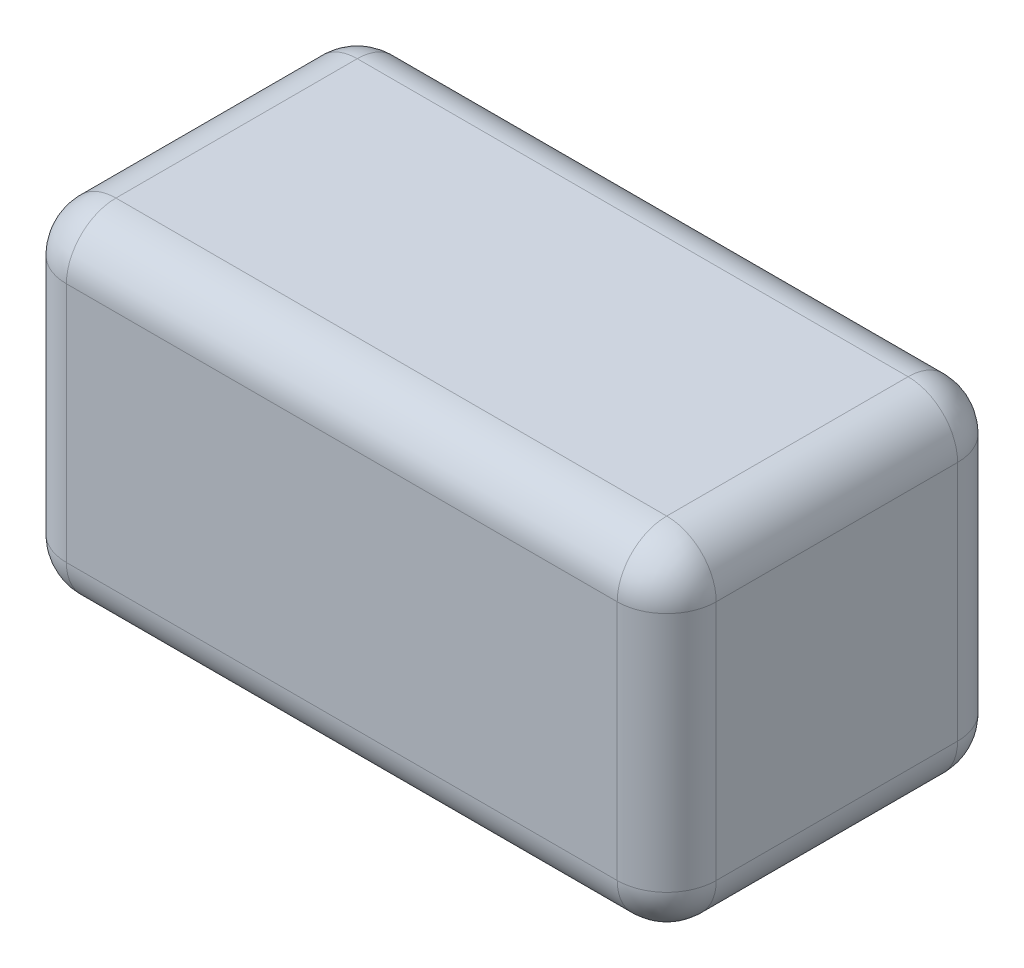
ISO-10303-21;
HEADER;
FILE_DESCRIPTION(('STEP AP214'),'2;1');
FILE_NAME('part.step','',(''),(''),'','','');
FILE_SCHEMA(('AUTOMOTIVE_DESIGN { 1 0 10303 214 1 1 1 1 }'));
ENDSEC;
DATA;
#1=APPLICATION_CONTEXT('core data for automotive mechanical design processes');
#2=APPLICATION_PROTOCOL_DEFINITION('international standard','automotive_design',2000,#1);
#3=PRODUCT_CONTEXT('',#1,'mechanical');
#4=PRODUCT('Part','Part','',(#3));
#5=PRODUCT_RELATED_PRODUCT_CATEGORY('part','',(#4));
#6=PRODUCT_DEFINITION_FORMATION('','',#4);
#7=PRODUCT_DEFINITION_CONTEXT('part definition',#1,'design');
#8=PRODUCT_DEFINITION('design','',#6,#7);
#9=PRODUCT_DEFINITION_SHAPE('','',#8);
#10=(LENGTH_UNIT() NAMED_UNIT(*) SI_UNIT(.MILLI.,.METRE.));
#11=(NAMED_UNIT(*) PLANE_ANGLE_UNIT() SI_UNIT($,.RADIAN.));
#12=(NAMED_UNIT(*) SI_UNIT($,.STERADIAN.) SOLID_ANGLE_UNIT());
#13=UNCERTAINTY_MEASURE_WITH_UNIT(LENGTH_MEASURE(1.E-05),#10,'distance_accuracy_value','');
#14=(GEOMETRIC_REPRESENTATION_CONTEXT(3) GLOBAL_UNCERTAINTY_ASSIGNED_CONTEXT((#13)) GLOBAL_UNIT_ASSIGNED_CONTEXT((#10,
#11,#12)) REPRESENTATION_CONTEXT('',''));
#15=CARTESIAN_POINT('',(0.,0.,0.));
#16=DIRECTION('',(0.,0.,1.));
#17=DIRECTION('',(1.,0.,0.));
#18=AXIS2_PLACEMENT_3D('',#15,#16,#17);
#19=CARTESIAN_POINT('',(0.445,0.195,0.47));
#20=DIRECTION('',(1.,0.,0.));
#21=DIRECTION('',(0.,1.,0.));
#22=AXIS2_PLACEMENT_3D('',#19,#20,#21);
#23=SPHERICAL_SURFACE('',#22,0.08);
#24=CARTESIAN_POINT('',(0.445,0.195,0.47));
#25=DIRECTION('',(1.,0.,0.));
#26=DIRECTION('',(0.,0.,-1.));
#27=AXIS2_PLACEMENT_3D('',#24,#25,#26);
#28=CIRCLE('',#27,0.08);
#29=CARTESIAN_POINT('',(0.445,0.195,0.55));
#30=VERTEX_POINT('',#29);
#31=CARTESIAN_POINT('',(0.445,0.275,0.470000000055542));
#32=VERTEX_POINT('',#31);
#33=EDGE_CURVE('E238',#30,#32,#28,.F.);
#34=ORIENTED_EDGE('',*,*,#33,.F.);
#35=CARTESIAN_POINT('',(0.445,0.195,0.47));
#36=DIRECTION('',(0.,-1.,0.));
#37=DIRECTION('',(1.,0.,0.));
#38=AXIS2_PLACEMENT_3D('',#35,#36,#37);
#39=CIRCLE('',#38,0.08);
#40=CARTESIAN_POINT('',(0.525,0.195,0.47));
#41=VERTEX_POINT('',#40);
#42=EDGE_CURVE('E134',#41,#30,#39,.T.);
#43=ORIENTED_EDGE('',*,*,#42,.F.);
#44=CARTESIAN_POINT('',(0.445,0.195,0.47));
#45=DIRECTION('',(0.,0.,-1.));
#46=DIRECTION('',(-1.,0.,0.));
#47=AXIS2_PLACEMENT_3D('',#44,#45,#46);
#48=CIRCLE('',#47,0.08);
#49=EDGE_CURVE('E211',#32,#41,#48,.T.);
#50=ORIENTED_EDGE('',*,*,#49,.F.);
#51=EDGE_LOOP('',(#34,#43,#50));
#52=FACE_BOUND('',#51,.T.);
#53=ADVANCED_FACE('F16',(#52),#23,.T.);
#54=CARTESIAN_POINT('',(-0.445,0.195,0.47));
#55=DIRECTION('',(0.,1.,0.));
#56=DIRECTION('',(-1.,0.,0.));
#57=AXIS2_PLACEMENT_3D('',#54,#55,#56);
#58=SPHERICAL_SURFACE('',#57,0.08);
#59=CARTESIAN_POINT('',(-0.445,0.195,0.47));
#60=DIRECTION('',(0.,-1.,0.));
#61=DIRECTION('',(0.,0.,-1.));
#62=AXIS2_PLACEMENT_3D('',#59,#60,#61);
#63=CIRCLE('',#62,0.08);
#64=CARTESIAN_POINT('',(-0.445,0.195000000110152,0.55));
#65=VERTEX_POINT('',#64);
#66=CARTESIAN_POINT('',(-0.525,0.195,0.47));
#67=VERTEX_POINT('',#66);
#68=EDGE_CURVE('E397',#65,#67,#63,.T.);
#69=ORIENTED_EDGE('',*,*,#68,.F.);
#70=CARTESIAN_POINT('',(-0.445,0.195,0.47));
#71=DIRECTION('',(1.,0.,0.));
#72=DIRECTION('',(0.,0.,-1.));
#73=AXIS2_PLACEMENT_3D('',#70,#71,#72);
#74=CIRCLE('',#73,0.08);
#75=CARTESIAN_POINT('',(-0.445,0.275,0.470000000111199));
#76=VERTEX_POINT('',#75);
#77=EDGE_CURVE('E237',#76,#65,#74,.T.);
#78=ORIENTED_EDGE('',*,*,#77,.F.);
#79=CARTESIAN_POINT('',(-0.445,0.195,0.47));
#80=DIRECTION('',(0.,0.,1.));
#81=DIRECTION('',(1.,0.,0.));
#82=AXIS2_PLACEMENT_3D('',#79,#80,#81);
#83=CIRCLE('',#82,0.08);
#84=EDGE_CURVE('E199',#67,#76,#83,.F.);
#85=ORIENTED_EDGE('',*,*,#84,.F.);
#86=EDGE_LOOP('',(#69,#78,#85));
#87=FACE_BOUND('',#86,.T.);
#88=ADVANCED_FACE('F224',(#87),#58,.T.);
#89=CARTESIAN_POINT('',(0.445,0.195,0.87));
#90=DIRECTION('',(0.,0.,-1.));
#91=DIRECTION('',(-1.,0.,0.));
#92=AXIS2_PLACEMENT_3D('',#89,#90,#91);
#93=CYLINDRICAL_SURFACE('',#92,0.08);
#94=CARTESIAN_POINT('',(0.445,0.195,0.08));
#95=DIRECTION('',(0.,0.,-1.));
#96=DIRECTION('',(0.,1.,0.));
#97=AXIS2_PLACEMENT_3D('',#94,#95,#96);
#98=CIRCLE('',#97,0.08);
#99=CARTESIAN_POINT('',(0.445,0.275,0.0799999998888023));
#100=VERTEX_POINT('',#99);
#101=CARTESIAN_POINT('',(0.525,0.195,0.0799999999999999));
#102=VERTEX_POINT('',#101);
#103=EDGE_CURVE('E197',#100,#102,#98,.T.);
#104=ORIENTED_EDGE('',*,*,#103,.F.);
#105=DIRECTION('',(0.,0.,1.));
#106=VECTOR('',#105,1.);
#107=CARTESIAN_POINT('',(0.445,0.275,0.));
#108=LINE('',#107,#106);
#109=EDGE_CURVE('E200',#32,#100,#108,.F.);
#110=ORIENTED_EDGE('',*,*,#109,.F.);
#111=ORIENTED_EDGE('',*,*,#49,.T.);
#112=DIRECTION('',(0.,0.,-1.));
#113=VECTOR('',#112,1.);
#114=CARTESIAN_POINT('',(0.525,0.195,0.55));
#115=LINE('',#114,#113);
#116=EDGE_CURVE('E216',#102,#41,#115,.F.);
#117=ORIENTED_EDGE('',*,*,#116,.F.);
#118=EDGE_LOOP('',(#104,#110,#111,#117));
#119=FACE_BOUND('',#118,.T.);
#120=ADVANCED_FACE('F221',(#119),#93,.T.);
#121=CARTESIAN_POINT('',(-0.445,0.195,0.08));
#122=DIRECTION('',(-1.,0.,0.));
#123=DIRECTION('',(0.,1.,0.));
#124=AXIS2_PLACEMENT_3D('',#121,#122,#123);
#125=SPHERICAL_SURFACE('',#124,0.08);
#126=CARTESIAN_POINT('',(-0.445,0.195,0.08));
#127=DIRECTION('',(0.,-1.,0.));
#128=DIRECTION('',(0.,0.,-1.));
#129=AXIS2_PLACEMENT_3D('',#126,#127,#128);
#130=CIRCLE('',#129,0.08);
#131=CARTESIAN_POINT('',(-0.525,0.195,0.08));
#132=VERTEX_POINT('',#131);
#133=CARTESIAN_POINT('',(-0.445,0.195,0.));
#134=VERTEX_POINT('',#133);
#135=EDGE_CURVE('E386',#132,#134,#130,.T.);
#136=ORIENTED_EDGE('',*,*,#135,.F.);
#137=CARTESIAN_POINT('',(-0.445,0.195,0.08));
#138=DIRECTION('',(0.,0.,1.));
#139=DIRECTION('',(1.,0.,0.));
#140=AXIS2_PLACEMENT_3D('',#137,#138,#139);
#141=CIRCLE('',#140,0.08);
#142=CARTESIAN_POINT('',(-0.445,0.275,0.08));
#143=VERTEX_POINT('',#142);
#144=EDGE_CURVE('E245',#143,#132,#141,.T.);
#145=ORIENTED_EDGE('',*,*,#144,.F.);
#146=CARTESIAN_POINT('',(-0.445,0.195,0.08));
#147=DIRECTION('',(-1.,0.,0.));
#148=DIRECTION('',(0.,0.,1.));
#149=AXIS2_PLACEMENT_3D('',#146,#147,#148);
#150=CIRCLE('',#149,0.08);
#151=EDGE_CURVE('E207',#134,#143,#150,.F.);
#152=ORIENTED_EDGE('',*,*,#151,.F.);
#153=EDGE_LOOP('',(#136,#145,#152));
#154=FACE_BOUND('',#153,.T.);
#155=ADVANCED_FACE('F218',(#154),#125,.T.);
#156=CARTESIAN_POINT('',(0.,0.275,0.));
#157=DIRECTION('',(0.,1.,0.));
#158=DIRECTION('',(0.,0.,1.));
#159=AXIS2_PLACEMENT_3D('',#156,#157,#158);
#160=PLANE('',#159);
#161=DIRECTION('',(1.,0.,0.));
#162=VECTOR('',#161,1.);
#163=CARTESIAN_POINT('',(-0.765,0.275,0.470000000222398));
#164=LINE('',#163,#162);
#165=EDGE_CURVE('E234',#32,#76,#164,.F.);
#166=ORIENTED_EDGE('',*,*,#165,.F.);
#167=ORIENTED_EDGE('',*,*,#109,.T.);
#168=DIRECTION('',(-1.,0.,0.));
#169=VECTOR('',#168,1.);
#170=CARTESIAN_POINT('',(0.765,0.275,0.0799999997776047));
#171=LINE('',#170,#169);
#172=EDGE_CURVE('E203',#143,#100,#171,.F.);
#173=ORIENTED_EDGE('',*,*,#172,.F.);
#174=DIRECTION('',(0.,0.,1.));
#175=VECTOR('',#174,1.);
#176=CARTESIAN_POINT('',(-0.445,0.275,-0.32));
#177=LINE('',#176,#175);
#178=EDGE_CURVE('E242',#76,#143,#177,.F.);
#179=ORIENTED_EDGE('',*,*,#178,.F.);
#180=EDGE_LOOP('',(#166,#167,#173,#179));
#181=FACE_BOUND('',#180,.T.);
#182=ADVANCED_FACE('F189',(#181),#160,.T.);
#183=CARTESIAN_POINT('',(0.445,0.195,0.08));
#184=DIRECTION('',(0.,1.,0.));
#185=DIRECTION('',(1.,0.,0.));
#186=AXIS2_PLACEMENT_3D('',#183,#184,#185);
#187=SPHERICAL_SURFACE('',#186,0.08);
#188=CARTESIAN_POINT('',(0.445,0.195,0.0799999999999999));
#189=DIRECTION('',(-1.,0.,0.));
#190=DIRECTION('',(0.,0.,1.));
#191=AXIS2_PLACEMENT_3D('',#188,#189,#190);
#192=CIRCLE('',#191,0.08);
#193=CARTESIAN_POINT('',(0.445,0.195000000110294,0.));
#194=VERTEX_POINT('',#193);
#195=EDGE_CURVE('E206',#100,#194,#192,.T.);
#196=ORIENTED_EDGE('',*,*,#195,.F.);
#197=ORIENTED_EDGE('',*,*,#103,.T.);
#198=CARTESIAN_POINT('',(0.445,0.195,0.0799999999999999));
#199=DIRECTION('',(0.,-1.,0.));
#200=DIRECTION('',(0.,0.,-1.));
#201=AXIS2_PLACEMENT_3D('',#198,#199,#200);
#202=CIRCLE('',#201,0.08);
#203=EDGE_CURVE('E383',#194,#102,#202,.T.);
#204=ORIENTED_EDGE('',*,*,#203,.F.);
#205=EDGE_LOOP('',(#196,#197,#204));
#206=FACE_BOUND('',#205,.T.);
#207=ADVANCED_FACE('F184',(#206),#187,.T.);
#208=CARTESIAN_POINT('',(-0.445,0.195,-0.32));
#209=DIRECTION('',(0.,0.,1.));
#210=DIRECTION('',(1.,0.,0.));
#211=AXIS2_PLACEMENT_3D('',#208,#209,#210);
#212=CYLINDRICAL_SURFACE('',#211,0.08);
#213=ORIENTED_EDGE('',*,*,#144,.T.);
#214=DIRECTION('',(0.,0.,1.));
#215=VECTOR('',#214,1.);
#216=CARTESIAN_POINT('',(-0.525,0.195,0.));
#217=LINE('',#216,#215);
#218=EDGE_CURVE('E415',#67,#132,#217,.F.);
#219=ORIENTED_EDGE('',*,*,#218,.F.);
#220=ORIENTED_EDGE('',*,*,#84,.T.);
#221=ORIENTED_EDGE('',*,*,#178,.T.);
#222=EDGE_LOOP('',(#213,#219,#220,#221));
#223=FACE_BOUND('',#222,.T.);
#224=ADVANCED_FACE('F181',(#223),#212,.T.);
#225=CARTESIAN_POINT('',(0.445,-0.515,0.47));
#226=DIRECTION('',(0.,-1.,0.));
#227=DIRECTION('',(1.,0.,0.));
#228=AXIS2_PLACEMENT_3D('',#225,#226,#227);
#229=CYLINDRICAL_SURFACE('',#228,0.08);
#230=DIRECTION('',(0.,1.,0.));
#231=VECTOR('',#230,1.);
#232=CARTESIAN_POINT('',(0.525,-0.275,0.47));
#233=LINE('',#232,#231);
#234=CARTESIAN_POINT('',(0.525,-0.195,0.47));
#235=VERTEX_POINT('',#234);
#236=EDGE_CURVE('E395',#41,#235,#233,.F.);
#237=ORIENTED_EDGE('',*,*,#236,.F.);
#238=ORIENTED_EDGE('',*,*,#42,.T.);
#239=DIRECTION('',(0.,1.,0.));
#240=VECTOR('',#239,1.);
#241=CARTESIAN_POINT('',(0.445,-0.275,0.55));
#242=LINE('',#241,#240);
#243=CARTESIAN_POINT('',(0.445,-0.195000000111199,0.55));
#244=VERTEX_POINT('',#243);
#245=EDGE_CURVE('E108',#244,#30,#242,.T.);
#246=ORIENTED_EDGE('',*,*,#245,.F.);
#247=CARTESIAN_POINT('',(0.445,-0.195,0.47));
#248=DIRECTION('',(0.,-1.,0.));
#249=DIRECTION('',(1.,0.,0.));
#250=AXIS2_PLACEMENT_3D('',#247,#248,#249);
#251=CIRCLE('',#250,0.08);
#252=EDGE_CURVE('E119',#235,#244,#251,.T.);
#253=ORIENTED_EDGE('',*,*,#252,.F.);
#254=EDGE_LOOP('',(#237,#238,#246,#253));
#255=FACE_BOUND('',#254,.T.);
#256=ADVANCED_FACE('F132',(#255),#229,.T.);
#257=CARTESIAN_POINT('',(-0.765,0.195,0.47));
#258=DIRECTION('',(1.,0.,0.));
#259=DIRECTION('',(0.,0.,-1.));
#260=AXIS2_PLACEMENT_3D('',#257,#258,#259);
#261=CYLINDRICAL_SURFACE('',#260,0.08);
#262=ORIENTED_EDGE('',*,*,#77,.T.);
#263=DIRECTION('',(1.,0.,0.));
#264=VECTOR('',#263,1.);
#265=CARTESIAN_POINT('',(-0.525,0.195000000220304,0.55));
#266=LINE('',#265,#264);
#267=EDGE_CURVE('E135',#30,#65,#266,.F.);
#268=ORIENTED_EDGE('',*,*,#267,.F.);
#269=ORIENTED_EDGE('',*,*,#33,.T.);
#270=ORIENTED_EDGE('',*,*,#165,.T.);
#271=EDGE_LOOP('',(#262,#268,#269,#270));
#272=FACE_BOUND('',#271,.T.);
#273=ADVANCED_FACE('F174',(#272),#261,.T.);
#274=CARTESIAN_POINT('',(-0.445,-0.515,0.47));
#275=DIRECTION('',(0.,-1.,0.));
#276=DIRECTION('',(0.,0.,-1.));
#277=AXIS2_PLACEMENT_3D('',#274,#275,#276);
#278=CYLINDRICAL_SURFACE('',#277,0.08);
#279=DIRECTION('',(0.,1.,0.));
#280=VECTOR('',#279,1.);
#281=CARTESIAN_POINT('',(-0.445,-0.275,0.55));
#282=LINE('',#281,#280);
#283=CARTESIAN_POINT('',(-0.445,-0.195,0.55));
#284=VERTEX_POINT('',#283);
#285=EDGE_CURVE('E102',#65,#284,#282,.F.);
#286=ORIENTED_EDGE('',*,*,#285,.F.);
#287=ORIENTED_EDGE('',*,*,#68,.T.);
#288=DIRECTION('',(0.,1.,0.));
#289=VECTOR('',#288,1.);
#290=CARTESIAN_POINT('',(-0.525,-0.275,0.47));
#291=LINE('',#290,#289);
#292=CARTESIAN_POINT('',(-0.525,-0.195,0.47));
#293=VERTEX_POINT('',#292);
#294=EDGE_CURVE('E392',#293,#67,#291,.T.);
#295=ORIENTED_EDGE('',*,*,#294,.F.);
#296=CARTESIAN_POINT('',(-0.445,-0.195,0.47));
#297=DIRECTION('',(0.,1.,0.));
#298=DIRECTION('',(-1.,0.,0.));
#299=AXIS2_PLACEMENT_3D('',#296,#297,#298);
#300=CIRCLE('',#299,0.08);
#301=EDGE_CURVE('E332',#284,#293,#300,.F.);
#302=ORIENTED_EDGE('',*,*,#301,.F.);
#303=EDGE_LOOP('',(#286,#287,#295,#302));
#304=FACE_BOUND('',#303,.T.);
#305=ADVANCED_FACE('F170',(#304),#278,.T.);
#306=CARTESIAN_POINT('',(0.525,-0.275,0.55));
#307=DIRECTION('',(1.,0.,0.));
#308=DIRECTION('',(0.,0.,-1.));
#309=AXIS2_PLACEMENT_3D('',#306,#307,#308);
#310=PLANE('',#309);
#311=DIRECTION('',(0.,-1.,0.));
#312=VECTOR('',#311,1.);
#313=CARTESIAN_POINT('',(0.525,-0.515,0.0799999999999999));
#314=LINE('',#313,#312);
#315=CARTESIAN_POINT('',(0.525,-0.195,0.0799999999999999));
#316=VERTEX_POINT('',#315);
#317=EDGE_CURVE('E387',#102,#316,#314,.T.);
#318=ORIENTED_EDGE('',*,*,#317,.F.);
#319=ORIENTED_EDGE('',*,*,#116,.T.);
#320=ORIENTED_EDGE('',*,*,#236,.T.);
#321=DIRECTION('',(0.,0.,1.));
#322=VECTOR('',#321,1.);
#323=CARTESIAN_POINT('',(0.525,-0.195,0.87));
#324=LINE('',#323,#322);
#325=EDGE_CURVE('E328',#316,#235,#324,.T.);
#326=ORIENTED_EDGE('',*,*,#325,.F.);
#327=EDGE_LOOP('',(#318,#319,#320,#326));
#328=FACE_BOUND('',#327,.T.);
#329=ADVANCED_FACE('F166',(#328),#310,.T.);
#330=CARTESIAN_POINT('',(0.445,-0.515,0.0799999999999999));
#331=DIRECTION('',(0.,-1.,0.));
#332=DIRECTION('',(0.,0.,-1.));
#333=AXIS2_PLACEMENT_3D('',#330,#331,#332);
#334=CYLINDRICAL_SURFACE('',#333,0.08);
#335=DIRECTION('',(0.,1.,0.));
#336=VECTOR('',#335,1.);
#337=CARTESIAN_POINT('',(0.445,-0.275,0.));
#338=LINE('',#337,#336);
#339=CARTESIAN_POINT('',(0.445,-0.195,0.));
#340=VERTEX_POINT('',#339);
#341=EDGE_CURVE('E324',#194,#340,#338,.F.);
#342=ORIENTED_EDGE('',*,*,#341,.F.);
#343=ORIENTED_EDGE('',*,*,#203,.T.);
#344=ORIENTED_EDGE('',*,*,#317,.T.);
#345=CARTESIAN_POINT('',(0.445,-0.195,0.08));
#346=DIRECTION('',(0.,1.,0.));
#347=DIRECTION('',(1.,0.,0.));
#348=AXIS2_PLACEMENT_3D('',#345,#346,#347);
#349=CIRCLE('',#348,0.08);
#350=EDGE_CURVE('E316',#340,#316,#349,.F.);
#351=ORIENTED_EDGE('',*,*,#350,.F.);
#352=EDGE_LOOP('',(#342,#343,#344,#351));
#353=FACE_BOUND('',#352,.T.);
#354=ADVANCED_FACE('F162',(#353),#334,.T.);
#355=CARTESIAN_POINT('',(-0.445,-0.515,0.08));
#356=DIRECTION('',(0.,-1.,0.));
#357=DIRECTION('',(0.,0.,-1.));
#358=AXIS2_PLACEMENT_3D('',#355,#356,#357);
#359=CYLINDRICAL_SURFACE('',#358,0.08);
#360=DIRECTION('',(0.,1.,0.));
#361=VECTOR('',#360,1.);
#362=CARTESIAN_POINT('',(-0.525,-0.275,0.0800000000000001));
#363=LINE('',#362,#361);
#364=CARTESIAN_POINT('',(-0.525,-0.195,0.08));
#365=VERTEX_POINT('',#364);
#366=EDGE_CURVE('E126',#132,#365,#363,.F.);
#367=ORIENTED_EDGE('',*,*,#366,.F.);
#368=ORIENTED_EDGE('',*,*,#135,.T.);
#369=DIRECTION('',(0.,1.,0.));
#370=VECTOR('',#369,1.);
#371=CARTESIAN_POINT('',(-0.445,-0.275,0.));
#372=LINE('',#371,#370);
#373=CARTESIAN_POINT('',(-0.445,-0.195000000115399,0.));
#374=VERTEX_POINT('',#373);
#375=EDGE_CURVE('E288',#374,#134,#372,.T.);
#376=ORIENTED_EDGE('',*,*,#375,.F.);
#377=CARTESIAN_POINT('',(-0.445,-0.195,0.08));
#378=DIRECTION('',(0.,-1.,0.));
#379=DIRECTION('',(-1.,0.,0.));
#380=AXIS2_PLACEMENT_3D('',#377,#378,#379);
#381=CIRCLE('',#380,0.08);
#382=EDGE_CURVE('E291',#365,#374,#381,.T.);
#383=ORIENTED_EDGE('',*,*,#382,.F.);
#384=EDGE_LOOP('',(#367,#368,#376,#383));
#385=FACE_BOUND('',#384,.T.);
#386=ADVANCED_FACE('F158',(#385),#359,.T.);
#387=CARTESIAN_POINT('',(0.765,0.195,0.0799999999999999));
#388=DIRECTION('',(-1.,0.,0.));
#389=DIRECTION('',(0.,0.,1.));
#390=AXIS2_PLACEMENT_3D('',#387,#388,#389);
#391=CYLINDRICAL_SURFACE('',#390,0.08);
#392=ORIENTED_EDGE('',*,*,#195,.T.);
#393=DIRECTION('',(-1.,0.,0.));
#394=VECTOR('',#393,1.);
#395=CARTESIAN_POINT('',(0.525,0.195,0.));
#396=LINE('',#395,#394);
#397=EDGE_CURVE('E281',#134,#194,#396,.F.);
#398=ORIENTED_EDGE('',*,*,#397,.F.);
#399=ORIENTED_EDGE('',*,*,#151,.T.);
#400=ORIENTED_EDGE('',*,*,#172,.T.);
#401=EDGE_LOOP('',(#392,#398,#399,#400));
#402=FACE_BOUND('',#401,.T.);
#403=ADVANCED_FACE('F154',(#402),#391,.T.);
#404=CARTESIAN_POINT('',(-0.525,-0.275,0.));
#405=DIRECTION('',(-1.,0.,0.));
#406=DIRECTION('',(0.,0.,1.));
#407=AXIS2_PLACEMENT_3D('',#404,#405,#406);
#408=PLANE('',#407);
#409=ORIENTED_EDGE('',*,*,#366,.T.);
#410=DIRECTION('',(0.,0.,-1.));
#411=VECTOR('',#410,1.);
#412=CARTESIAN_POINT('',(-0.525,-0.195,-0.32));
#413=LINE('',#412,#411);
#414=EDGE_CURVE('E280',#293,#365,#413,.T.);
#415=ORIENTED_EDGE('',*,*,#414,.F.);
#416=ORIENTED_EDGE('',*,*,#294,.T.);
#417=ORIENTED_EDGE('',*,*,#218,.T.);
#418=EDGE_LOOP('',(#409,#415,#416,#417));
#419=FACE_BOUND('',#418,.T.);
#420=ADVANCED_FACE('F150',(#419),#408,.T.);
#421=CARTESIAN_POINT('',(0.445,-0.195,0.47));
#422=DIRECTION('',(0.,-1.,0.));
#423=DIRECTION('',(1.,0.,0.));
#424=AXIS2_PLACEMENT_3D('',#421,#422,#423);
#425=SPHERICAL_SURFACE('',#424,0.08);
#426=CARTESIAN_POINT('',(0.445,-0.195,0.47));
#427=DIRECTION('',(-1.,0.,0.));
#428=DIRECTION('',(0.,0.,1.));
#429=AXIS2_PLACEMENT_3D('',#426,#427,#428);
#430=CIRCLE('',#429,0.08);
#431=CARTESIAN_POINT('',(0.445,-0.275,0.470000000165372));
#432=VERTEX_POINT('',#431);
#433=EDGE_CURVE('E114',#432,#244,#430,.T.);
#434=ORIENTED_EDGE('',*,*,#433,.F.);
#435=CARTESIAN_POINT('',(0.445,-0.195,0.47));
#436=DIRECTION('',(0.,0.,1.));
#437=DIRECTION('',(1.,0.,0.));
#438=AXIS2_PLACEMENT_3D('',#435,#436,#437);
#439=CIRCLE('',#438,0.08);
#440=EDGE_CURVE('E122',#235,#432,#439,.F.);
#441=ORIENTED_EDGE('',*,*,#440,.F.);
#442=ORIENTED_EDGE('',*,*,#252,.T.);
#443=EDGE_LOOP('',(#434,#441,#442));
#444=FACE_BOUND('',#443,.T.);
#445=ADVANCED_FACE('F120',(#444),#425,.T.);
#446=CARTESIAN_POINT('',(-0.525,-0.275,0.55));
#447=DIRECTION('',(0.,0.,1.));
#448=DIRECTION('',(1.,0.,0.));
#449=AXIS2_PLACEMENT_3D('',#446,#447,#448);
#450=PLANE('',#449);
#451=ORIENTED_EDGE('',*,*,#285,.T.);
#452=DIRECTION('',(1.,0.,0.));
#453=VECTOR('',#452,1.);
#454=CARTESIAN_POINT('',(-0.525,-0.195,0.55));
#455=LINE('',#454,#453);
#456=EDGE_CURVE('E20',#244,#284,#455,.F.);
#457=ORIENTED_EDGE('',*,*,#456,.F.);
#458=ORIENTED_EDGE('',*,*,#245,.T.);
#459=ORIENTED_EDGE('',*,*,#267,.T.);
#460=EDGE_LOOP('',(#451,#457,#458,#459));
#461=FACE_BOUND('',#460,.T.);
#462=ADVANCED_FACE('F106',(#461),#450,.T.);
#463=CARTESIAN_POINT('',(-0.445,-0.195,0.47));
#464=DIRECTION('',(-1.,0.,0.));
#465=DIRECTION('',(0.,-1.,0.));
#466=AXIS2_PLACEMENT_3D('',#463,#464,#465);
#467=SPHERICAL_SURFACE('',#466,0.08);
#468=CARTESIAN_POINT('',(-0.445,-0.195,0.47));
#469=DIRECTION('',(0.,0.,-1.));
#470=DIRECTION('',(-1.,0.,0.));
#471=AXIS2_PLACEMENT_3D('',#468,#469,#470);
#472=CIRCLE('',#471,0.08);
#473=CARTESIAN_POINT('',(-0.445,-0.275,0.47));
#474=VERTEX_POINT('',#473);
#475=EDGE_CURVE('E277',#474,#293,#472,.T.);
#476=ORIENTED_EDGE('',*,*,#475,.F.);
#477=CARTESIAN_POINT('',(-0.445,-0.195,0.47));
#478=DIRECTION('',(-1.,0.,0.));
#479=DIRECTION('',(0.,0.,1.));
#480=AXIS2_PLACEMENT_3D('',#477,#478,#479);
#481=CIRCLE('',#480,0.08);
#482=EDGE_CURVE('E113',#284,#474,#481,.F.);
#483=ORIENTED_EDGE('',*,*,#482,.F.);
#484=ORIENTED_EDGE('',*,*,#301,.T.);
#485=EDGE_LOOP('',(#476,#483,#484));
#486=FACE_BOUND('',#485,.T.);
#487=ADVANCED_FACE('F338',(#486),#467,.T.);
#488=CARTESIAN_POINT('',(0.445,-0.195,0.87));
#489=DIRECTION('',(0.,0.,1.));
#490=DIRECTION('',(1.,0.,0.));
#491=AXIS2_PLACEMENT_3D('',#488,#489,#490);
#492=CYLINDRICAL_SURFACE('',#491,0.08);
#493=CARTESIAN_POINT('',(0.445,-0.195,0.08));
#494=DIRECTION('',(0.,0.,-1.));
#495=DIRECTION('',(1.,0.,0.));
#496=AXIS2_PLACEMENT_3D('',#493,#494,#495);
#497=CIRCLE('',#496,0.08);
#498=CARTESIAN_POINT('',(0.445,-0.275,0.08));
#499=VERTEX_POINT('',#498);
#500=EDGE_CURVE('E319',#316,#499,#497,.T.);
#501=ORIENTED_EDGE('',*,*,#500,.F.);
#502=ORIENTED_EDGE('',*,*,#325,.T.);
#503=ORIENTED_EDGE('',*,*,#440,.T.);
#504=DIRECTION('',(0.,0.,1.));
#505=VECTOR('',#504,1.);
#506=CARTESIAN_POINT('',(0.445,-0.275,0.));
#507=LINE('',#506,#505);
#508=EDGE_CURVE('E261',#432,#499,#507,.F.);
#509=ORIENTED_EDGE('',*,*,#508,.T.);
#510=EDGE_LOOP('',(#501,#502,#503,#509));
#511=FACE_BOUND('',#510,.T.);
#512=ADVANCED_FACE('F309',(#511),#492,.T.);
#513=CARTESIAN_POINT('',(0.445,-0.195,0.08));
#514=DIRECTION('',(1.,0.,0.));
#515=DIRECTION('',(0.,-1.,0.));
#516=AXIS2_PLACEMENT_3D('',#513,#514,#515);
#517=SPHERICAL_SURFACE('',#516,0.08);
#518=CARTESIAN_POINT('',(0.445,-0.195,0.0799999999999999));
#519=DIRECTION('',(1.,0.,0.));
#520=DIRECTION('',(0.,0.,-1.));
#521=AXIS2_PLACEMENT_3D('',#518,#519,#520);
#522=CIRCLE('',#521,0.08);
#523=EDGE_CURVE('E257',#340,#499,#522,.F.);
#524=ORIENTED_EDGE('',*,*,#523,.F.);
#525=ORIENTED_EDGE('',*,*,#350,.T.);
#526=ORIENTED_EDGE('',*,*,#500,.T.);
#527=EDGE_LOOP('',(#524,#525,#526));
#528=FACE_BOUND('',#527,.T.);
#529=ADVANCED_FACE('F303',(#528),#517,.T.);
#530=CARTESIAN_POINT('',(-0.445,-0.195,0.08));
#531=DIRECTION('',(0.,-1.,0.));
#532=DIRECTION('',(-1.,0.,0.));
#533=AXIS2_PLACEMENT_3D('',#530,#531,#532);
#534=SPHERICAL_SURFACE('',#533,0.08);
#535=CARTESIAN_POINT('',(-0.445,-0.195,0.08));
#536=DIRECTION('',(0.,0.,-1.));
#537=DIRECTION('',(-1.,0.,0.));
#538=AXIS2_PLACEMENT_3D('',#535,#536,#537);
#539=CIRCLE('',#538,0.08);
#540=CARTESIAN_POINT('',(-0.445,-0.275,0.0799999998331354));
#541=VERTEX_POINT('',#540);
#542=EDGE_CURVE('E129',#365,#541,#539,.F.);
#543=ORIENTED_EDGE('',*,*,#542,.F.);
#544=ORIENTED_EDGE('',*,*,#382,.T.);
#545=CARTESIAN_POINT('',(-0.445,-0.195,0.08));
#546=DIRECTION('',(1.,0.,0.));
#547=DIRECTION('',(0.,0.,-1.));
#548=AXIS2_PLACEMENT_3D('',#545,#546,#547);
#549=CIRCLE('',#548,0.08);
#550=EDGE_CURVE('E249',#541,#374,#549,.T.);
#551=ORIENTED_EDGE('',*,*,#550,.F.);
#552=EDGE_LOOP('',(#543,#544,#551));
#553=FACE_BOUND('',#552,.T.);
#554=ADVANCED_FACE('F298',(#553),#534,.T.);
#555=CARTESIAN_POINT('',(0.525,-0.275,0.));
#556=DIRECTION('',(0.,0.,-1.));
#557=DIRECTION('',(-1.,0.,0.));
#558=AXIS2_PLACEMENT_3D('',#555,#556,#557);
#559=PLANE('',#558);
#560=ORIENTED_EDGE('',*,*,#341,.T.);
#561=DIRECTION('',(-1.,0.,0.));
#562=VECTOR('',#561,1.);
#563=CARTESIAN_POINT('',(0.525,-0.195000000230797,0.));
#564=LINE('',#563,#562);
#565=EDGE_CURVE('E247',#374,#340,#564,.F.);
#566=ORIENTED_EDGE('',*,*,#565,.F.);
#567=ORIENTED_EDGE('',*,*,#375,.T.);
#568=ORIENTED_EDGE('',*,*,#397,.T.);
#569=EDGE_LOOP('',(#560,#566,#567,#568));
#570=FACE_BOUND('',#569,.T.);
#571=ADVANCED_FACE('F302',(#570),#559,.T.);
#572=CARTESIAN_POINT('',(-0.445,-0.195,-0.32));
#573=DIRECTION('',(0.,0.,-1.));
#574=DIRECTION('',(-1.,0.,0.));
#575=AXIS2_PLACEMENT_3D('',#572,#573,#574);
#576=CYLINDRICAL_SURFACE('',#575,0.08);
#577=ORIENTED_EDGE('',*,*,#542,.T.);
#578=DIRECTION('',(0.,0.,1.));
#579=VECTOR('',#578,1.);
#580=CARTESIAN_POINT('',(-0.445,-0.275,0.));
#581=LINE('',#580,#579);
#582=EDGE_CURVE('E248',#541,#474,#581,.T.);
#583=ORIENTED_EDGE('',*,*,#582,.T.);
#584=ORIENTED_EDGE('',*,*,#475,.T.);
#585=ORIENTED_EDGE('',*,*,#414,.T.);
#586=EDGE_LOOP('',(#577,#583,#584,#585));
#587=FACE_BOUND('',#586,.T.);
#588=ADVANCED_FACE('F358',(#587),#576,.T.);
#589=CARTESIAN_POINT('',(-0.765,-0.195,0.47));
#590=DIRECTION('',(-1.,0.,0.));
#591=DIRECTION('',(0.,0.,1.));
#592=AXIS2_PLACEMENT_3D('',#589,#590,#591);
#593=CYLINDRICAL_SURFACE('',#592,0.08);
#594=ORIENTED_EDGE('',*,*,#482,.T.);
#595=DIRECTION('',(1.,0.,0.));
#596=VECTOR('',#595,1.);
#597=CARTESIAN_POINT('',(0.,-0.275,0.470000000225338));
#598=LINE('',#597,#596);
#599=EDGE_CURVE('E26',#474,#432,#598,.T.);
#600=ORIENTED_EDGE('',*,*,#599,.T.);
#601=ORIENTED_EDGE('',*,*,#433,.T.);
#602=ORIENTED_EDGE('',*,*,#456,.T.);
#603=EDGE_LOOP('',(#594,#600,#601,#602));
#604=FACE_BOUND('',#603,.T.);
#605=ADVANCED_FACE('F128',(#604),#593,.T.);
#606=CARTESIAN_POINT('',(0.765,-0.195,0.0799999999999999));
#607=DIRECTION('',(1.,0.,0.));
#608=DIRECTION('',(0.,0.,-1.));
#609=AXIS2_PLACEMENT_3D('',#606,#607,#608);
#610=CYLINDRICAL_SURFACE('',#609,0.08);
#611=ORIENTED_EDGE('',*,*,#550,.T.);
#612=ORIENTED_EDGE('',*,*,#565,.T.);
#613=ORIENTED_EDGE('',*,*,#523,.T.);
#614=DIRECTION('',(1.,0.,0.));
#615=VECTOR('',#614,1.);
#616=CARTESIAN_POINT('',(0.,-0.275,0.0799999997776325));
#617=LINE('',#616,#615);
#618=EDGE_CURVE('E11',#499,#541,#617,.F.);
#619=ORIENTED_EDGE('',*,*,#618,.T.);
#620=EDGE_LOOP('',(#611,#612,#613,#619));
#621=FACE_BOUND('',#620,.T.);
#622=ADVANCED_FACE('F350',(#621),#610,.T.);
#623=CARTESIAN_POINT('',(0.,-0.275,0.));
#624=DIRECTION('',(0.,1.,0.));
#625=DIRECTION('',(0.,0.,1.));
#626=AXIS2_PLACEMENT_3D('',#623,#624,#625);
#627=PLANE('',#626);
#628=ORIENTED_EDGE('',*,*,#582,.F.);
#629=ORIENTED_EDGE('',*,*,#618,.F.);
#630=ORIENTED_EDGE('',*,*,#508,.F.);
#631=ORIENTED_EDGE('',*,*,#599,.F.);
#632=EDGE_LOOP('',(#628,#629,#630,#631));
#633=FACE_BOUND('',#632,.T.);
#634=ADVANCED_FACE('F348',(#633),#627,.F.);
#635=CLOSED_SHELL('',(#53,#88,#120,#155,#182,#207,#224,#256,#273,#305,#329,#354,#386,#403,#420,
#445,#462,#487,#512,#529,#554,#571,#588,#605,#622,#634));
#636=MANIFOLD_SOLID_BREP('B1',#635);
#637=ADVANCED_BREP_SHAPE_REPRESENTATION('',(#18,#636),#14);
#638=SHAPE_DEFINITION_REPRESENTATION(#9,#637);
ENDSEC;
END-ISO-10303-21;
